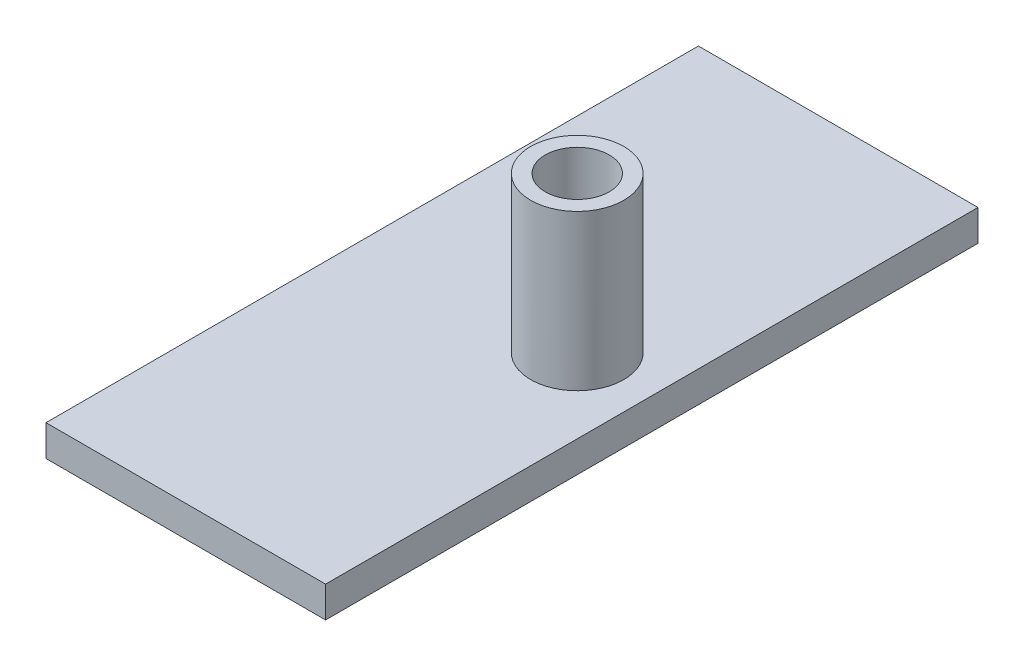
ISO-10303-21;
HEADER;
FILE_DESCRIPTION(('STEP AP214'),'2;1');
FILE_NAME('part.step','',(''),(''),'','','');
FILE_SCHEMA(('AUTOMOTIVE_DESIGN { 1 0 10303 214 1 1 1 1 }'));
ENDSEC;
DATA;
#1=APPLICATION_CONTEXT('core data for automotive mechanical design processes');
#2=APPLICATION_PROTOCOL_DEFINITION('international standard','automotive_design',2000,#1);
#3=PRODUCT_CONTEXT('',#1,'mechanical');
#4=PRODUCT('Part','Part','',(#3));
#5=PRODUCT_RELATED_PRODUCT_CATEGORY('part','',(#4));
#6=PRODUCT_DEFINITION_FORMATION('','',#4);
#7=PRODUCT_DEFINITION_CONTEXT('part definition',#1,'design');
#8=PRODUCT_DEFINITION('design','',#6,#7);
#9=PRODUCT_DEFINITION_SHAPE('','',#8);
#10=(LENGTH_UNIT() NAMED_UNIT(*) SI_UNIT(.MILLI.,.METRE.));
#11=(NAMED_UNIT(*) PLANE_ANGLE_UNIT() SI_UNIT($,.RADIAN.));
#12=(NAMED_UNIT(*) SI_UNIT($,.STERADIAN.) SOLID_ANGLE_UNIT());
#13=UNCERTAINTY_MEASURE_WITH_UNIT(LENGTH_MEASURE(1.E-05),#10,'distance_accuracy_value','');
#14=(GEOMETRIC_REPRESENTATION_CONTEXT(3) GLOBAL_UNCERTAINTY_ASSIGNED_CONTEXT((#13)) GLOBAL_UNIT_ASSIGNED_CONTEXT((#10,
#11,#12)) REPRESENTATION_CONTEXT('',''));
#15=CARTESIAN_POINT('',(0.,0.,0.));
#16=DIRECTION('',(0.,0.,1.));
#17=DIRECTION('',(1.,0.,0.));
#18=AXIS2_PLACEMENT_3D('',#15,#16,#17);
#19=CARTESIAN_POINT('',(0.,5.,0.));
#20=DIRECTION('',(-1.,0.,0.));
#21=DIRECTION('',(0.,0.,1.));
#22=AXIS2_PLACEMENT_3D('',#19,#20,#21);
#23=PLANE('',#22);
#24=DIRECTION('',(0.,0.,-1.));
#25=VECTOR('',#24,1.);
#26=CARTESIAN_POINT('',(0.,0.,0.));
#27=LINE('',#26,#25);
#28=CARTESIAN_POINT('',(0.,0.,0.));
#29=VERTEX_POINT('',#28);
#30=CARTESIAN_POINT('',(0.,0.,-105.));
#31=VERTEX_POINT('',#30);
#32=EDGE_CURVE('E105',#29,#31,#27,.T.);
#33=ORIENTED_EDGE('',*,*,#32,.F.);
#34=DIRECTION('',(0.,-1.,0.));
#35=VECTOR('',#34,1.);
#36=CARTESIAN_POINT('',(0.,5.,0.));
#37=LINE('',#36,#35);
#38=CARTESIAN_POINT('',(0.,5.,0.));
#39=VERTEX_POINT('',#38);
#40=EDGE_CURVE('E45',#39,#29,#37,.T.);
#41=ORIENTED_EDGE('',*,*,#40,.F.);
#42=DIRECTION('',(0.,0.,-1.));
#43=VECTOR('',#42,1.);
#44=CARTESIAN_POINT('',(0.,5.,0.));
#45=LINE('',#44,#43);
#46=CARTESIAN_POINT('',(0.,5.,-105.));
#47=VERTEX_POINT('',#46);
#48=EDGE_CURVE('E99',#39,#47,#45,.T.);
#49=ORIENTED_EDGE('',*,*,#48,.T.);
#50=DIRECTION('',(0.,-1.,0.));
#51=VECTOR('',#50,1.);
#52=CARTESIAN_POINT('',(0.,5.,-105.));
#53=LINE('',#52,#51);
#54=EDGE_CURVE('E77',#47,#31,#53,.T.);
#55=ORIENTED_EDGE('',*,*,#54,.T.);
#56=EDGE_LOOP('',(#33,#41,#49,#55));
#57=FACE_BOUND('',#56,.T.);
#58=ADVANCED_FACE('F37',(#57),#23,.T.);
#59=CARTESIAN_POINT('',(0.,5.,0.));
#60=DIRECTION('',(0.,0.,-1.));
#61=DIRECTION('',(-1.,0.,0.));
#62=AXIS2_PLACEMENT_3D('',#59,#60,#61);
#63=PLANE('',#62);
#64=DIRECTION('',(1.,0.,0.));
#65=VECTOR('',#64,1.);
#66=CARTESIAN_POINT('',(0.,0.,0.));
#67=LINE('',#66,#65);
#68=CARTESIAN_POINT('',(45.,0.,0.));
#69=VERTEX_POINT('',#68);
#70=EDGE_CURVE('E69',#29,#69,#67,.T.);
#71=ORIENTED_EDGE('',*,*,#70,.T.);
#72=DIRECTION('',(0.,-1.,0.));
#73=VECTOR('',#72,1.);
#74=CARTESIAN_POINT('',(45.,5.,0.));
#75=LINE('',#74,#73);
#76=CARTESIAN_POINT('',(45.,5.,0.));
#77=VERTEX_POINT('',#76);
#78=EDGE_CURVE('E96',#77,#69,#75,.T.);
#79=ORIENTED_EDGE('',*,*,#78,.F.);
#80=DIRECTION('',(1.,0.,0.));
#81=VECTOR('',#80,1.);
#82=CARTESIAN_POINT('',(0.,5.,0.));
#83=LINE('',#82,#81);
#84=EDGE_CURVE('E87',#39,#77,#83,.T.);
#85=ORIENTED_EDGE('',*,*,#84,.F.);
#86=ORIENTED_EDGE('',*,*,#40,.T.);
#87=EDGE_LOOP('',(#71,#79,#85,#86));
#88=FACE_BOUND('',#87,.T.);
#89=ADVANCED_FACE('F130',(#88),#63,.F.);
#90=CARTESIAN_POINT('',(45.,5.,0.));
#91=DIRECTION('',(-1.,0.,0.));
#92=DIRECTION('',(0.,0.,1.));
#93=AXIS2_PLACEMENT_3D('',#90,#91,#92);
#94=PLANE('',#93);
#95=DIRECTION('',(0.,0.,-1.));
#96=VECTOR('',#95,1.);
#97=CARTESIAN_POINT('',(45.,0.,0.));
#98=LINE('',#97,#96);
#99=CARTESIAN_POINT('',(45.,0.,-105.));
#100=VERTEX_POINT('',#99);
#101=EDGE_CURVE('E94',#69,#100,#98,.T.);
#102=ORIENTED_EDGE('',*,*,#101,.T.);
#103=DIRECTION('',(0.,-1.,0.));
#104=VECTOR('',#103,1.);
#105=CARTESIAN_POINT('',(45.,5.,-105.));
#106=LINE('',#105,#104);
#107=CARTESIAN_POINT('',(45.,5.,-105.));
#108=VERTEX_POINT('',#107);
#109=EDGE_CURVE('E91',#108,#100,#106,.T.);
#110=ORIENTED_EDGE('',*,*,#109,.F.);
#111=DIRECTION('',(0.,0.,-1.));
#112=VECTOR('',#111,1.);
#113=CARTESIAN_POINT('',(45.,5.,0.));
#114=LINE('',#113,#112);
#115=EDGE_CURVE('E82',#77,#108,#114,.T.);
#116=ORIENTED_EDGE('',*,*,#115,.F.);
#117=ORIENTED_EDGE('',*,*,#78,.T.);
#118=EDGE_LOOP('',(#102,#110,#116,#117));
#119=FACE_BOUND('',#118,.T.);
#120=ADVANCED_FACE('F92',(#119),#94,.F.);
#121=CARTESIAN_POINT('',(0.,5.,-105.));
#122=DIRECTION('',(0.,0.,-1.));
#123=DIRECTION('',(-1.,0.,0.));
#124=AXIS2_PLACEMENT_3D('',#121,#122,#123);
#125=PLANE('',#124);
#126=DIRECTION('',(1.,0.,0.));
#127=VECTOR('',#126,1.);
#128=CARTESIAN_POINT('',(0.,0.,-105.));
#129=LINE('',#128,#127);
#130=EDGE_CURVE('E108',#31,#100,#129,.T.);
#131=ORIENTED_EDGE('',*,*,#130,.F.);
#132=ORIENTED_EDGE('',*,*,#54,.F.);
#133=DIRECTION('',(1.,0.,0.));
#134=VECTOR('',#133,1.);
#135=CARTESIAN_POINT('',(0.,5.,-105.));
#136=LINE('',#135,#134);
#137=EDGE_CURVE('E86',#47,#108,#136,.T.);
#138=ORIENTED_EDGE('',*,*,#137,.T.);
#139=ORIENTED_EDGE('',*,*,#109,.T.);
#140=EDGE_LOOP('',(#131,#132,#138,#139));
#141=FACE_BOUND('',#140,.T.);
#142=ADVANCED_FACE('F98',(#141),#125,.T.);
#143=CARTESIAN_POINT('',(0.,5.,0.));
#144=DIRECTION('',(0.,-1.,0.));
#145=DIRECTION('',(0.,0.,-1.));
#146=AXIS2_PLACEMENT_3D('',#143,#144,#145);
#147=PLANE('',#146);
#148=CARTESIAN_POINT('',(32.9999999999999,5.,-52.5));
#149=DIRECTION('',(0.,-1.,0.));
#150=DIRECTION('',(0.,0.,-1.));
#151=AXIS2_PLACEMENT_3D('',#148,#149,#150);
#152=CIRCLE('',#151,7.49999999999994);
#153=CARTESIAN_POINT('',(32.9999999999999,5.,-59.9999999999999));
#154=VERTEX_POINT('',#153);
#155=EDGE_CURVE('E11',#154,#154,#152,.F.);
#156=ORIENTED_EDGE('',*,*,#155,.F.);
#157=EDGE_LOOP('',(#156));
#158=FACE_BOUND('',#157,.T.);
#159=ORIENTED_EDGE('',*,*,#48,.F.);
#160=ORIENTED_EDGE('',*,*,#84,.T.);
#161=ORIENTED_EDGE('',*,*,#115,.T.);
#162=ORIENTED_EDGE('',*,*,#137,.F.);
#163=EDGE_LOOP('',(#159,#160,#161,#162));
#164=FACE_BOUND('',#163,.T.);
#165=ADVANCED_FACE('F85',(#158,#164),#147,.F.);
#166=CARTESIAN_POINT('',(0.,0.,0.));
#167=DIRECTION('',(0.,-1.,0.));
#168=DIRECTION('',(0.,0.,-1.));
#169=AXIS2_PLACEMENT_3D('',#166,#167,#168);
#170=PLANE('',#169);
#171=ORIENTED_EDGE('',*,*,#32,.T.);
#172=ORIENTED_EDGE('',*,*,#130,.T.);
#173=ORIENTED_EDGE('',*,*,#101,.F.);
#174=ORIENTED_EDGE('',*,*,#70,.F.);
#175=EDGE_LOOP('',(#171,#172,#173,#174));
#176=FACE_BOUND('',#175,.T.);
#177=ADVANCED_FACE('F115',(#176),#170,.T.);
#178=CARTESIAN_POINT('',(32.9999999999999,30.,-52.5));
#179=DIRECTION('',(0.,-1.,0.));
#180=DIRECTION('',(0.,0.,-1.));
#181=AXIS2_PLACEMENT_3D('',#178,#179,#180);
#182=CYLINDRICAL_SURFACE('',#181,7.49999999999994);
#183=CARTESIAN_POINT('',(32.9999999999999,30.,-52.5));
#184=DIRECTION('',(0.,1.,0.));
#185=DIRECTION('',(0.,0.,1.));
#186=AXIS2_PLACEMENT_3D('',#183,#184,#185);
#187=CIRCLE('',#186,7.49999999999994);
#188=CARTESIAN_POINT('',(32.9999999999999,30.,-45.0000000000001));
#189=VERTEX_POINT('',#188);
#190=EDGE_CURVE('E109',#189,#189,#187,.T.);
#191=ORIENTED_EDGE('',*,*,#190,.F.);
#192=EDGE_LOOP('',(#191));
#193=FACE_BOUND('',#192,.T.);
#194=ORIENTED_EDGE('',*,*,#155,.T.);
#195=EDGE_LOOP('',(#194));
#196=FACE_BOUND('',#195,.T.);
#197=ADVANCED_FACE('F117',(#193,#196),#182,.T.);
#198=CARTESIAN_POINT('',(32.9999999999999,30.,-52.5));
#199=DIRECTION('',(0.,1.,0.));
#200=DIRECTION('',(0.,0.,1.));
#201=AXIS2_PLACEMENT_3D('',#198,#199,#200);
#202=PLANE('',#201);
#203=CARTESIAN_POINT('',(32.9999999999999,30.,-52.5));
#204=DIRECTION('',(0.,1.,0.));
#205=DIRECTION('',(0.,0.,1.));
#206=AXIS2_PLACEMENT_3D('',#203,#204,#205);
#207=CIRCLE('',#206,5.15);
#208=CARTESIAN_POINT('',(32.9999999999999,30.,-47.35));
#209=VERTEX_POINT('',#208);
#210=EDGE_CURVE('E227',#209,#209,#207,.T.);
#211=ORIENTED_EDGE('',*,*,#210,.F.);
#212=EDGE_LOOP('',(#211));
#213=FACE_BOUND('',#212,.T.);
#214=ORIENTED_EDGE('',*,*,#190,.T.);
#215=EDGE_LOOP('',(#214));
#216=FACE_BOUND('',#215,.T.);
#217=ADVANCED_FACE('F123',(#213,#216),#202,.T.);
#218=CARTESIAN_POINT('',(32.9999999999999,10.,-52.5));
#219=DIRECTION('',(0.,1.,0.));
#220=DIRECTION('',(0.,0.,1.));
#221=AXIS2_PLACEMENT_3D('',#218,#219,#220);
#222=CYLINDRICAL_SURFACE('',#221,5.15);
#223=CARTESIAN_POINT('',(32.9999999999999,10.,-52.5));
#224=DIRECTION('',(0.,1.,0.));
#225=DIRECTION('',(0.,0.,1.));
#226=AXIS2_PLACEMENT_3D('',#223,#224,#225);
#227=CIRCLE('',#226,5.15);
#228=CARTESIAN_POINT('',(32.9999999999999,10.,-47.35));
#229=VERTEX_POINT('',#228);
#230=EDGE_CURVE('E226',#229,#229,#227,.T.);
#231=ORIENTED_EDGE('',*,*,#230,.F.);
#232=EDGE_LOOP('',(#231));
#233=FACE_BOUND('',#232,.T.);
#234=ORIENTED_EDGE('',*,*,#210,.T.);
#235=EDGE_LOOP('',(#234));
#236=FACE_BOUND('',#235,.T.);
#237=ADVANCED_FACE('F166',(#233,#236),#222,.F.);
#238=CARTESIAN_POINT('',(32.9999999999999,10.,-52.5));
#239=DIRECTION('',(0.,1.,0.));
#240=DIRECTION('',(0.,0.,1.));
#241=AXIS2_PLACEMENT_3D('',#238,#239,#240);
#242=PLANE('',#241);
#243=ORIENTED_EDGE('',*,*,#230,.T.);
#244=EDGE_LOOP('',(#243));
#245=FACE_BOUND('',#244,.T.);
#246=ADVANCED_FACE('F177',(#245),#242,.T.);
#247=CLOSED_SHELL('',(#58,#89,#120,#142,#165,#177,#197,#217,#237,#246));
#248=MANIFOLD_SOLID_BREP('B2',#247);
#249=ADVANCED_BREP_SHAPE_REPRESENTATION('',(#18,#248),#14);
#250=SHAPE_DEFINITION_REPRESENTATION(#9,#249);
ENDSEC;
END-ISO-10303-21;
